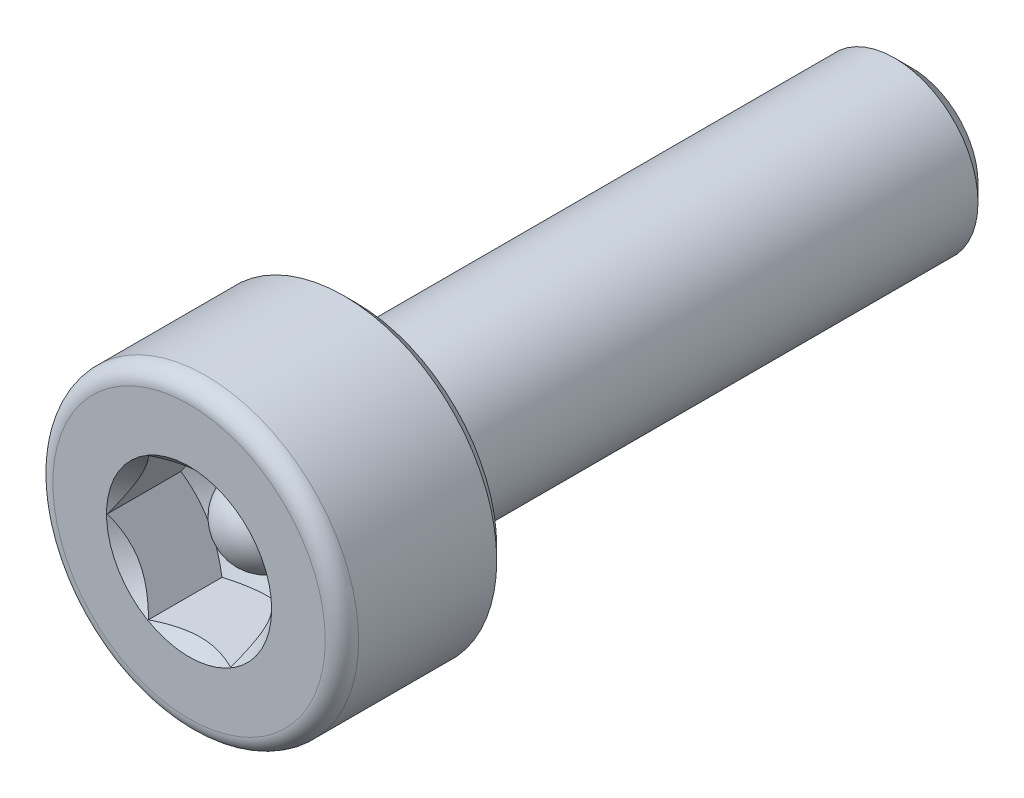
ISO-10303-21;
HEADER;
FILE_DESCRIPTION(('STEP AP214'),'2;1');
FILE_NAME('part.step','',(''),(''),'','','');
FILE_SCHEMA(('AUTOMOTIVE_DESIGN { 1 0 10303 214 1 1 1 1 }'));
ENDSEC;
DATA;
#1=APPLICATION_CONTEXT('core data for automotive mechanical design processes');
#2=APPLICATION_PROTOCOL_DEFINITION('international standard','automotive_design',2000,#1);
#3=PRODUCT_CONTEXT('',#1,'mechanical');
#4=PRODUCT('Part','Part','',(#3));
#5=PRODUCT_RELATED_PRODUCT_CATEGORY('part','',(#4));
#6=PRODUCT_DEFINITION_FORMATION('','',#4);
#7=PRODUCT_DEFINITION_CONTEXT('part definition',#1,'design');
#8=PRODUCT_DEFINITION('design','',#6,#7);
#9=PRODUCT_DEFINITION_SHAPE('','',#8);
#10=(LENGTH_UNIT() NAMED_UNIT(*) SI_UNIT(.MILLI.,.METRE.));
#11=(NAMED_UNIT(*) PLANE_ANGLE_UNIT() SI_UNIT($,.RADIAN.));
#12=(NAMED_UNIT(*) SI_UNIT($,.STERADIAN.) SOLID_ANGLE_UNIT());
#13=UNCERTAINTY_MEASURE_WITH_UNIT(LENGTH_MEASURE(1.E-05),#10,'distance_accuracy_value','');
#14=(GEOMETRIC_REPRESENTATION_CONTEXT(3) GLOBAL_UNCERTAINTY_ASSIGNED_CONTEXT((#13)) GLOBAL_UNIT_ASSIGNED_CONTEXT((#10,
#11,#12)) REPRESENTATION_CONTEXT('',''));
#15=CARTESIAN_POINT('',(0.,0.,0.));
#16=DIRECTION('',(0.,0.,1.));
#17=DIRECTION('',(1.,0.,0.));
#18=AXIS2_PLACEMENT_3D('',#15,#16,#17);
#19=CARTESIAN_POINT('',(0.,0.,1.615850938766));
#20=DIRECTION('',(1.,0.,0.));
#21=DIRECTION('',(0.,-1.,0.));
#22=AXIS2_PLACEMENT_3D('',#19,#20,#21);
#23=SPHERICAL_SURFACE('',#22,0.739008344563);
#24=CARTESIAN_POINT('',(0.739008344562999,0.,1.615850938766));
#25=VERTEX_POINT('',#24);
#26=VERTEX_LOOP('',#25);
#27=FACE_BOUND('',#26,.T.);
#28=CARTESIAN_POINT('',(-0.739008344563001,0.,1.615850938766));
#29=VERTEX_POINT('',#28);
#30=VERTEX_LOOP('',#29);
#31=FACE_BOUND('',#30,.T.);
#32=ADVANCED_FACE('P0_F16',(#27,#31),#23,.T.);
#33=CLOSED_SHELL('',(#32));
#34=MANIFOLD_SOLID_BREP('P0_B1',#33);
#35=CARTESIAN_POINT('',(0.,0.,-0.1));
#36=DIRECTION('',(0.,0.,-1.));
#37=DIRECTION('',(-1.,0.,0.));
#38=AXIS2_PLACEMENT_3D('',#35,#36,#37);
#39=CYLINDRICAL_SURFACE('',#38,1.5);
#40=CARTESIAN_POINT('',(0.,0.,-9.693282669493));
#41=DIRECTION('',(0.,0.,-1.));
#42=DIRECTION('',(-1.,0.,0.));
#43=AXIS2_PLACEMENT_3D('',#40,#41,#42);
#44=CIRCLE('',#43,1.5);
#45=CARTESIAN_POINT('',(-1.5,0.,-9.693282669493));
#46=VERTEX_POINT('',#45);
#47=EDGE_CURVE('P1_E30',#46,#46,#44,.F.);
#48=ORIENTED_EDGE('',*,*,#47,.T.);
#49=EDGE_LOOP('',(#48));
#50=FACE_BOUND('',#49,.T.);
#51=CARTESIAN_POINT('',(0.,0.,-0.1));
#52=DIRECTION('',(0.,0.,-1.));
#53=DIRECTION('',(-1.,0.,0.));
#54=AXIS2_PLACEMENT_3D('',#51,#52,#53);
#55=CIRCLE('',#54,1.5);
#56=CARTESIAN_POINT('',(-1.5,0.,-0.1));
#57=VERTEX_POINT('',#56);
#58=EDGE_CURVE('P1_E11',#57,#57,#55,.T.);
#59=ORIENTED_EDGE('',*,*,#58,.T.);
#60=EDGE_LOOP('',(#59));
#61=FACE_BOUND('',#60,.T.);
#62=ADVANCED_FACE('P1_F17',(#50,#61),#39,.T.);
#63=CARTESIAN_POINT('',(0.,0.,-0.1));
#64=DIRECTION('',(0.,0.,-1.));
#65=DIRECTION('',(1.,0.,0.));
#66=AXIS2_PLACEMENT_3D('',#63,#64,#65);
#67=TOROIDAL_SURFACE('',#66,1.6,0.1);
#68=ORIENTED_EDGE('',*,*,#58,.F.);
#69=EDGE_LOOP('',(#68));
#70=FACE_BOUND('',#69,.T.);
#71=CARTESIAN_POINT('',(0.,0.,0.));
#72=DIRECTION('',(0.,0.,-1.));
#73=DIRECTION('',(1.,0.,0.));
#74=AXIS2_PLACEMENT_3D('',#71,#72,#73);
#75=CIRCLE('',#74,1.6);
#76=CARTESIAN_POINT('',(1.6,0.,0.));
#77=VERTEX_POINT('',#76);
#78=EDGE_CURVE('P1_E123',#77,#77,#75,.F.);
#79=ORIENTED_EDGE('',*,*,#78,.F.);
#80=EDGE_LOOP('',(#79));
#81=FACE_BOUND('',#80,.T.);
#82=ADVANCED_FACE('P1_F295',(#70,#81),#67,.F.);
#83=CARTESIAN_POINT('',(0.,0.,-9.69328266961611));
#84=DIRECTION('',(0.,0.,1.));
#85=DIRECTION('',(1.,0.,0.));
#86=AXIS2_PLACEMENT_3D('',#83,#84,#85);
#87=CONICAL_SURFACE('',#86,1.49999999990769,0.785398163397448);
#88=CARTESIAN_POINT('',(0.,0.,-9.99999999999091));
#89=DIRECTION('',(0.,0.,1.));
#90=DIRECTION('',(1.,0.,0.));
#91=AXIS2_PLACEMENT_3D('',#88,#89,#90);
#92=CIRCLE('',#91,1.19328266953289);
#93=CARTESIAN_POINT('',(1.19328266953289,0.,-9.99999999999091));
#94=VERTEX_POINT('',#93);
#95=EDGE_CURVE('P1_E120',#94,#94,#92,.T.);
#96=ORIENTED_EDGE('',*,*,#95,.T.);
#97=EDGE_LOOP('',(#96));
#98=FACE_BOUND('',#97,.T.);
#99=ORIENTED_EDGE('',*,*,#47,.F.);
#100=EDGE_LOOP('',(#99));
#101=FACE_BOUND('',#100,.T.);
#102=ADVANCED_FACE('P1_F286',(#98,#101),#87,.T.);
#103=CARTESIAN_POINT('',(0.,0.,0.));
#104=DIRECTION('',(0.,0.,1.));
#105=DIRECTION('',(1.,0.,0.));
#106=AXIS2_PLACEMENT_3D('',#103,#104,#105);
#107=PLANE('',#106);
#108=ORIENTED_EDGE('',*,*,#78,.T.);
#109=EDGE_LOOP('',(#108));
#110=FACE_BOUND('',#109,.T.);
#111=CARTESIAN_POINT('',(0.,0.,0.));
#112=DIRECTION('',(0.,0.,1.));
#113=DIRECTION('',(1.,0.,0.));
#114=AXIS2_PLACEMENT_3D('',#111,#112,#113);
#115=CIRCLE('',#114,2.5349999999662);
#116=CARTESIAN_POINT('',(2.5349999999662,0.,0.));
#117=VERTEX_POINT('',#116);
#118=EDGE_CURVE('P1_E124',#117,#117,#115,.T.);
#119=ORIENTED_EDGE('',*,*,#118,.F.);
#120=EDGE_LOOP('',(#119));
#121=FACE_BOUND('',#120,.T.);
#122=ADVANCED_FACE('P1_F277',(#110,#121),#107,.F.);
#123=CARTESIAN_POINT('',(0.,0.,-10.));
#124=DIRECTION('',(0.,0.,1.));
#125=DIRECTION('',(1.,0.,0.));
#126=AXIS2_PLACEMENT_3D('',#123,#124,#125);
#127=PLANE('',#126);
#128=ORIENTED_EDGE('',*,*,#95,.F.);
#129=EDGE_LOOP('',(#128));
#130=FACE_BOUND('',#129,.T.);
#131=ADVANCED_FACE('P1_F268',(#130),#127,.F.);
#132=CARTESIAN_POINT('',(0.,0.,0.215000000025612));
#133=DIRECTION('',(0.,0.,1.));
#134=DIRECTION('',(1.,0.,0.));
#135=AXIS2_PLACEMENT_3D('',#132,#133,#134);
#136=CONICAL_SURFACE('',#135,2.74999999993497,0.785398163265254);
#137=ORIENTED_EDGE('',*,*,#118,.T.);
#138=EDGE_LOOP('',(#137));
#139=FACE_BOUND('',#138,.T.);
#140=CARTESIAN_POINT('',(0.,0.,0.215000000025612));
#141=DIRECTION('',(0.,0.,1.));
#142=DIRECTION('',(1.,0.,0.));
#143=AXIS2_PLACEMENT_3D('',#140,#141,#142);
#144=CIRCLE('',#143,2.74999999993497);
#145=CARTESIAN_POINT('',(2.74999999993497,0.,0.215000000025612));
#146=VERTEX_POINT('',#145);
#147=EDGE_CURVE('P1_E127',#146,#146,#144,.F.);
#148=ORIENTED_EDGE('',*,*,#147,.T.);
#149=EDGE_LOOP('',(#148));
#150=FACE_BOUND('',#149,.T.);
#151=ADVANCED_FACE('P1_F259',(#139,#150),#136,.T.);
#152=CARTESIAN_POINT('',(0.,0.,2.7));
#153=DIRECTION('',(0.,0.,-1.));
#154=DIRECTION('',(-1.,0.,0.));
#155=AXIS2_PLACEMENT_3D('',#152,#153,#154);
#156=CYLINDRICAL_SURFACE('',#155,2.75);
#157=ORIENTED_EDGE('',*,*,#147,.F.);
#158=EDGE_LOOP('',(#157));
#159=FACE_BOUND('',#158,.T.);
#160=CARTESIAN_POINT('',(0.,0.,2.7));
#161=DIRECTION('',(0.,0.,-1.));
#162=DIRECTION('',(-1.,0.,0.));
#163=AXIS2_PLACEMENT_3D('',#160,#161,#162);
#164=CIRCLE('',#163,2.75);
#165=CARTESIAN_POINT('',(-2.75,0.,2.7));
#166=VERTEX_POINT('',#165);
#167=EDGE_CURVE('P1_E434',#166,#166,#164,.T.);
#168=ORIENTED_EDGE('',*,*,#167,.T.);
#169=EDGE_LOOP('',(#168));
#170=FACE_BOUND('',#169,.T.);
#171=ADVANCED_FACE('P1_F251',(#159,#170),#156,.T.);
#172=CARTESIAN_POINT('',(0.,0.,2.7));
#173=DIRECTION('',(0.,0.,-1.));
#174=DIRECTION('',(1.,0.,0.));
#175=AXIS2_PLACEMENT_3D('',#172,#173,#174);
#176=TOROIDAL_SURFACE('',#175,2.45,0.3);
#177=ORIENTED_EDGE('',*,*,#167,.F.);
#178=EDGE_LOOP('',(#177));
#179=FACE_BOUND('',#178,.T.);
#180=CARTESIAN_POINT('',(0.,0.,3.));
#181=DIRECTION('',(0.,0.,-1.));
#182=DIRECTION('',(1.,0.,0.));
#183=AXIS2_PLACEMENT_3D('',#180,#181,#182);
#184=CIRCLE('',#183,2.45);
#185=CARTESIAN_POINT('',(2.45,0.,3.));
#186=VERTEX_POINT('',#185);
#187=EDGE_CURVE('P1_E131',#186,#186,#184,.F.);
#188=ORIENTED_EDGE('',*,*,#187,.F.);
#189=EDGE_LOOP('',(#188));
#190=FACE_BOUND('',#189,.T.);
#191=ADVANCED_FACE('P1_F243',(#179,#190),#176,.T.);
#192=CARTESIAN_POINT('',(0.,0.,3.));
#193=DIRECTION('',(0.,0.,1.));
#194=DIRECTION('',(1.,0.,0.));
#195=AXIS2_PLACEMENT_3D('',#192,#193,#194);
#196=PLANE('',#195);
#197=ORIENTED_EDGE('',*,*,#187,.T.);
#198=EDGE_LOOP('',(#197));
#199=FACE_BOUND('',#198,.T.);
#200=CARTESIAN_POINT('',(0.,0.,2.99999999998591));
#201=DIRECTION('',(0.,0.,1.));
#202=DIRECTION('',(1.,0.,0.));
#203=AXIS2_PLACEMENT_3D('',#200,#201,#202);
#204=CIRCLE('',#203,1.4854439087344);
#205=CARTESIAN_POINT('',(1.4854439087344,0.,2.99999999998591));
#206=VERTEX_POINT('',#205);
#207=EDGE_CURVE('P1_E128',#206,#206,#204,.F.);
#208=ORIENTED_EDGE('',*,*,#207,.T.);
#209=EDGE_LOOP('',(#208));
#210=FACE_BOUND('',#209,.T.);
#211=ADVANCED_FACE('P1_F150',(#199,#210),#196,.T.);
#212=CARTESIAN_POINT('',(0.,0.,2.99999999998591));
#213=DIRECTION('',(0.,0.,1.));
#214=DIRECTION('',(1.,0.,0.));
#215=AXIS2_PLACEMENT_3D('',#212,#213,#214);
#216=CONICAL_SURFACE('',#215,1.4854439087344,0.785398163397448);
#217=ORIENTED_EDGE('',*,*,#207,.F.);
#218=EDGE_LOOP('',(#217));
#219=FACE_BOUND('',#218,.T.);
#220=CARTESIAN_POINT('',(-0.73900833039765,1.28000002453511,2.99257279454244));
#221=CARTESIAN_POINT('',(-0.764408407762743,1.23600580002261,2.96719708967992));
#222=CARTESIAN_POINT('',(-0.790233176713148,1.1912759881068,2.94331199094595));
#223=CARTESIAN_POINT('',(-0.842892530835465,1.10006731127323,2.89957939484165));
#224=CARTESIAN_POINT('',(-0.869732121178957,1.05357977714399,2.87975622232529));
#225=CARTESIAN_POINT('',(-0.923852835173947,0.959839950762813,2.84579898979231));
#226=CARTESIAN_POINT('',(-0.951120183396314,0.912611518254026,2.83157960268337));
#227=CARTESIAN_POINT('',(-1.0062550176399,0.817115184077292,2.80967194523321));
#228=CARTESIAN_POINT('',(-1.03412082054732,0.768850197647961,2.80196732772804));
#229=CARTESIAN_POINT('',(-1.08215006859365,0.68566109978243,2.79501535623299));
#230=CARTESIAN_POINT('',(-1.10225153047865,0.650844346491229,2.79398660559318));
#231=CARTESIAN_POINT('',(-1.14241907185677,0.581272124009232,2.795722599224));
#232=CARTESIAN_POINT('',(-1.16248514255375,0.546516670053808,2.79848818146684));
#233=CARTESIAN_POINT('',(-1.20242355510745,0.477341310337187,2.80765297004438));
#234=CARTESIAN_POINT('',(-1.22229569931528,0.442921746913914,2.814055555235));
#235=CARTESIAN_POINT('',(-1.26170819927281,0.374657294534199,2.83014952360517));
#236=CARTESIAN_POINT('',(-1.28124840886902,0.340812658723032,2.83984231799677));
#237=CARTESIAN_POINT('',(-1.3312711614295,0.254170709753885,2.86859538704998));
#238=CARTESIAN_POINT('',(-1.3614389218517,0.201918615952089,2.88981369969133));
#239=CARTESIAN_POINT('',(-1.42059417461341,0.0994587126342793,2.93760802816772));
#240=CARTESIAN_POINT('',(-1.44958514902605,0.0492448719906819,2.9641666033907));
#241=CARTESIAN_POINT('',(-1.47801665262797,6.32166031965428E-08,2.99257274387948));
#242=B_SPLINE_CURVE_WITH_KNOTS('',3,(#220,#221,#222,#223,#224,#225,#226,#227,#228,#229,#230,
#231,#232,#233,#234,#235,#236,#237,#238,#239,#240,#241),.UNSPECIFIED.,.F.,.F.,(4,2,2,2,2,2,2,2,
2,2,4),(0.,0.170474178045342,0.341941186072123,0.510685878115575,0.679005880861946,
0.799483496257405,0.919987723220982,1.04060408478871,1.16127224573515,1.35282268707442,
1.54375742347497),.UNSPECIFIED.);
#243=CARTESIAN_POINT('',(-0.739008307823175,1.28,2.99257276200718));
#244=VERTEX_POINT('',#243);
#245=CARTESIAN_POINT('',(-1.47801667075188,3.18241214037053E-08,2.99257276200339));
#246=VERTEX_POINT('',#245);
#247=EDGE_CURVE('P1_E39',#244,#246,#242,.T.);
#248=ORIENTED_EDGE('',*,*,#247,.F.);
#249=CARTESIAN_POINT('',(0.739008272408615,1.28000000611594,2.99257274094721));
#250=CARTESIAN_POINT('',(0.688208122719239,1.28000000220067,2.96719704334762));
#251=CARTESIAN_POINT('',(0.636558590484335,1.28000000059091,2.94331195077126));
#252=CARTESIAN_POINT('',(0.531239894532555,1.27999999940565,2.89957936559876));
#253=CARTESIAN_POINT('',(0.477560720480201,1.27999999984207,2.87975619784138));
#254=CARTESIAN_POINT('',(0.369319305960669,1.28000000015542,2.8457989740032));
#255=CARTESIAN_POINT('',(0.314784616340693,1.28000000004114,2.83157959085406));
#256=CARTESIAN_POINT('',(0.20451496200542,1.27999999995897,2.80967193977415));
#257=CARTESIAN_POINT('',(0.148783363515357,1.27999999999072,2.80196732468796));
#258=CARTESIAN_POINT('',(0.0527248750781001,1.28000000000665,2.7950153553539));
#259=CARTESIAN_POINT('',(0.0125219515476335,1.28000000000178,2.79398660539415));
#260=CARTESIAN_POINT('',(-0.0678131306698069,1.27999999999822,2.79572260032543));
#261=CARTESIAN_POINT('',(-0.107945271764465,1.27999999999952,2.79848818318913));
#262=CARTESIAN_POINT('',(-0.187822096259195,1.28000000000048,2.80765297292113));
#263=CARTESIAN_POINT('',(-0.22756638436111,1.28000000000013,2.8140555586481));
#264=CARTESIAN_POINT('',(-0.306391383623088,1.27999999999987,2.83014952798809));
#265=CARTESIAN_POINT('',(-0.34547180247616,1.27999999999996,2.83984232281309));
#266=CARTESIAN_POINT('',(-0.445517304080995,1.28000000000007,2.86859539209756));
#267=CARTESIAN_POINT('',(-0.505852821834524,1.28000000000004,2.88981370415139));
#268=CARTESIAN_POINT('',(-0.62416332131743,1.27999999999997,2.93760803081389));
#269=CARTESIAN_POINT('',(-0.682145267195324,1.27999999999993,2.96416660480513));
#270=CARTESIAN_POINT('',(-0.739008271582371,1.28,2.99257274388677));
#271=B_SPLINE_CURVE_WITH_KNOTS('',3,(#249,#250,#251,#252,#253,#254,#255,#256,#257,#258,#259,
#260,#261,#262,#263,#264,#265,#266,#267,#268,#269,#270),.UNSPECIFIED.,.F.,.F.,(4,2,2,2,2,2,2,2,
2,2,4),(0.,0.17047415492173,0.341941139416434,0.510685808711829,0.679005788888608,
0.799483403509875,0.919987629713267,1.04060399061424,1.16127215089304,1.35282258295895,
1.54375730985654),.UNSPECIFIED.);
#272=CARTESIAN_POINT('',(0.739008337482733,1.28000001226243,2.99257278745654));
#273=VERTEX_POINT('',#272);
#274=EDGE_CURVE('P1_E165',#273,#244,#271,.T.);
#275=ORIENTED_EDGE('',*,*,#274,.F.);
#276=CARTESIAN_POINT('',(1.47801667853174,1.8348056452837E-08,2.99257276978325));
#277=CARTESIAN_POINT('',(1.45261660259499,0.0439942403865975,2.96719706761263));
#278=CARTESIAN_POINT('',(1.42679183511048,0.08872404976341,2.94331197153223));
#279=CARTESIAN_POINT('',(1.37413248406308,0.179932721271057,2.89957938050909));
#280=CARTESIAN_POINT('',(1.34729289533023,0.226420252610582,2.87975621041389));
#281=CARTESIAN_POINT('',(1.29317218473374,0.320160073105397,2.84579898225534));
#282=CARTESIAN_POINT('',(1.26590483829921,0.367388502517554,2.83157959709393));
#283=CARTESIAN_POINT('',(1.21077000774575,0.462884830302806,2.80967194275167));
#284=CARTESIAN_POINT('',(1.18290420673992,0.511149813438469,2.80196732641221));
#285=CARTESIAN_POINT('',(1.13487496071501,0.594338907802802,2.7950153558772));
#286=CARTESIAN_POINT('',(1.11477349892741,0.629155660925311,2.79398660551534));
#287=CARTESIAN_POINT('',(1.07460595775605,0.698727883049189,2.79572259966083));
#288=CARTESIAN_POINT('',(1.05453988716844,0.733483336815178,2.79848818214051));
#289=CARTESIAN_POINT('',(1.01460147479739,0.802658696215434,2.80765297114743));
#290=CARTESIAN_POINT('',(0.994729330663319,0.83707825951096,2.81405555653851));
#291=CARTESIAN_POINT('',(0.95531683085651,0.905342711629617,2.83014952526765));
#292=CARTESIAN_POINT('',(0.935776621337286,0.939187347307438,2.83984231981792));
#293=CARTESIAN_POINT('',(0.885753860349397,1.02582931087329,2.86859539417932));
#294=CARTESIAN_POINT('',(0.855586091716678,1.07808141889612,2.88981371394575));
#295=CARTESIAN_POINT('',(0.79643082320749,1.18054134948936,2.93760805912835));
#296=CARTESIAN_POINT('',(0.767439841253866,1.23075520319432,2.9641666439137));
#297=CARTESIAN_POINT('',(0.739008330402467,1.28000002452487,2.99257279453598));
#298=B_SPLINE_CURVE_WITH_KNOTS('',3,(#276,#277,#278,#279,#280,#281,#282,#283,#284,#285,#286,
#287,#288,#289,#290,#291,#292,#293,#294,#295,#296,#297),.UNSPECIFIED.,.F.,.F.,(4,2,2,2,2,2,2,2,
2,2,4),(0.,0.170474166745542,0.341941163208504,0.510685843446508,0.679005834505185,
0.799483449295664,0.91998767565746,1.040604036887,1.16127219750169,1.35282269216248,
1.54375748133644),.UNSPECIFIED.);
#299=CARTESIAN_POINT('',(1.47801667853205,-4.26931163012624E-13,2.99257276978356));
#300=VERTEX_POINT('',#299);
#301=EDGE_CURVE('P1_E171',#300,#273,#298,.T.);
#302=ORIENTED_EDGE('',*,*,#301,.F.);
#303=CARTESIAN_POINT('',(0.739008330397649,-1.28000002453511,2.99257279454244));
#304=CARTESIAN_POINT('',(0.764408407784721,-1.23600579998454,2.96719708965798));
#305=CARTESIAN_POINT('',(0.790233176757962,-1.19127598802918,2.94331199090453));
#306=CARTESIAN_POINT('',(0.842892530927419,-1.10006731111396,2.89957939476955));
#307=CARTESIAN_POINT('',(0.869732121295217,-1.05357977694262,2.87975622224202));
#308=CARTESIAN_POINT('',(0.923852835292992,-0.959839950556622,2.84579898972774));
#309=CARTESIAN_POINT('',(0.951120183492341,-0.912611518087701,2.83157960263935));
#310=CARTESIAN_POINT('',(1.00625501768864,-0.817115183992871,2.80967194521967));
#311=CARTESIAN_POINT('',(1.0341208205718,-0.768850197605565,2.80196732772449));
#312=CARTESIAN_POINT('',(1.08215006858505,-0.685661099797333,2.79501535623424));
#313=CARTESIAN_POINT('',(1.10225153046139,-0.650844346521124,2.79398660559405));
#314=CARTESIAN_POINT('',(1.14241907182218,-0.581272124069146,2.79572259922089));
#315=CARTESIAN_POINT('',(1.16248514251048,-0.546516670128749,2.79848818146012));
#316=CARTESIAN_POINT('',(1.20242355506417,-0.477341310412151,2.80765297003124));
#317=CARTESIAN_POINT('',(1.22229569928048,-0.442921746974186,2.81405555522214));
#318=CARTESIAN_POINT('',(1.26170819925536,-0.374657294564425,2.8301495235967));
#319=CARTESIAN_POINT('',(1.28124840886042,-0.340812658737923,2.83984231799251));
#320=CARTESIAN_POINT('',(1.33127116608195,-0.254170701695607,2.86859538972314));
#321=CARTESIAN_POINT('',(1.36143893099818,-0.201918600109919,2.8898137061194));
#322=CARTESIAN_POINT('',(1.42059419239467,-0.0994586818362385,2.9376080434876));
#323=CARTESIAN_POINT('',(1.44958517094973,-0.0492448340177656,2.96416662383977));
#324=CARTESIAN_POINT('',(1.47801667853235,-1.83489103127095E-08,2.99257276978386));
#325=B_SPLINE_CURVE_WITH_KNOTS('',3,(#303,#304,#305,#306,#307,#308,#309,#310,#311,#312,#313,
#314,#315,#316,#317,#318,#319,#320,#321,#322,#323,#324),.UNSPECIFIED.,.F.,.F.,(4,2,2,2,2,2,2,2,
2,2,4),(0.,0.170474178193379,0.341941186367865,0.510685878262844,0.679005880862118,
0.7994834962059,0.919987723117027,1.04060408473501,1.16127224573534,1.35282271611338,
1.54375748134627),.UNSPECIFIED.);
#326=CARTESIAN_POINT('',(0.739008307823175,-1.28,2.99257276200718));
#327=VERTEX_POINT('',#326);
#328=EDGE_CURVE('P1_E95',#327,#300,#325,.T.);
#329=ORIENTED_EDGE('',*,*,#328,.F.);
#330=CARTESIAN_POINT('',(-0.739008372896817,-1.28,2.992572794544));
#331=CARTESIAN_POINT('',(-0.688208218166412,-1.28,2.96719708968126));
#332=CARTESIAN_POINT('',(-0.636558680265378,-1.28,2.94331199094707));
#333=CARTESIAN_POINT('',(-0.53123997202027,-1.28,2.89957939484236));
#334=CARTESIAN_POINT('',(-0.477560791333037,-1.28,2.87975622232579));
#335=CARTESIAN_POINT('',(-0.369319363342573,-1.28,2.84579898979248));
#336=CARTESIAN_POINT('',(-0.314784666897608,-1.28,2.83157960268339));
#337=CARTESIAN_POINT('',(-0.204514998409948,-1.28,2.809671945233));
#338=CARTESIAN_POINT('',(-0.148783392594856,-1.28,2.80196732772774));
#339=CARTESIAN_POINT('',(-0.0527248965019614,-1.28,2.79501535623261));
#340=CARTESIAN_POINT('',(-0.0125219727319932,-1.28,2.79398660559279));
#341=CARTESIAN_POINT('',(0.0678131100242127,-1.28,2.79572259922356));
#342=CARTESIAN_POINT('',(0.107945251418159,-1.28,2.79848818146638));
#343=CARTESIAN_POINT('',(0.187822076525533,-1.28,2.80765297004388));
#344=CARTESIAN_POINT('',(0.227566364941178,-1.28,2.81405555523448));
#345=CARTESIAN_POINT('',(0.306391364856226,-1.28,2.83014952360461));
#346=CARTESIAN_POINT('',(0.345471784048643,-1.28,2.8398423179962));
#347=CARTESIAN_POINT('',(0.445517289172432,-1.28,2.8685953870502));
#348=CARTESIAN_POINT('',(0.505852810019584,-1.28,2.88981369969269));
#349=CARTESIAN_POINT('',(0.624163315548282,-1.28,2.93760802817178));
#350=CARTESIAN_POINT('',(0.682145264376096,-1.28,2.96416660339633));
#351=CARTESIAN_POINT('',(0.739008271582371,-1.28,2.99257274388677));
#352=B_SPLINE_CURVE_WITH_KNOTS('',3,(#330,#331,#332,#333,#334,#335,#336,#337,#338,#339,#340,
#341,#342,#343,#344,#345,#346,#347,#348,#349,#350,#351),.UNSPECIFIED.,.F.,.F.,(4,2,2,2,2,2,2,2,
2,2,4),(0.,0.170474178046279,0.34194118607402,0.510685878118316,0.679005880865522,
0.799483496260969,0.919987723224533,1.04060408479228,1.16127224573873,1.35282268708692,
1.54375742349635),.UNSPECIFIED.);
#353=CARTESIAN_POINT('',(-0.739008362932853,-1.27999996818058,2.99257276200559));
#354=VERTEX_POINT('',#353);
#355=EDGE_CURVE('P1_E93',#354,#327,#352,.T.);
#356=ORIENTED_EDGE('',*,*,#355,.F.);
#357=CARTESIAN_POINT('',(-1.47801670328417,2.45243962858424E-08,2.99257279453568));
#358=CARTESIAN_POINT('',(-1.45261662591942,-0.0439941999874959,2.9671970896738));
#359=CARTESIAN_POINT('',(-1.42679185696938,-0.088724011902678,2.94331199094046));
#360=CARTESIAN_POINT('',(-1.37413250284782,-0.179932688734942,2.89957939483736));
#361=CARTESIAN_POINT('',(-1.34729291250472,-0.2264202228635,2.87975622232157));
#362=CARTESIAN_POINT('',(-1.29317219851055,-0.320160049243261,2.84579898978961));
#363=CARTESIAN_POINT('',(-1.2659048502886,-0.367388481751313,2.83157960268112));
#364=CARTESIAN_POINT('',(-1.21077001604589,-0.462884815926531,2.80967194523168));
#365=CARTESIAN_POINT('',(-1.18290421313892,-0.51114980235508,2.80196732772679));
#366=CARTESIAN_POINT('',(-1.13487496509308,-0.594338900219759,2.79501535623196));
#367=CARTESIAN_POINT('',(-1.11477350320812,-0.6291556535109,2.79398660559222));
#368=CARTESIAN_POINT('',(-1.07460596183007,-0.69872787599277,2.79572259922315));
#369=CARTESIAN_POINT('',(-1.05453989113313,-0.733483329948128,2.79848818146604));
#370=CARTESIAN_POINT('',(-1.0146014785795,-0.802658689664624,2.80765297004368));
#371=CARTESIAN_POINT('',(-0.994729334371709,-0.83707825308784,2.81405555523434));
#372=CARTESIAN_POINT('',(-0.955316834414246,-0.905342705467438,2.83014952360458));
#373=CARTESIAN_POINT('',(-0.935776624818068,-0.939187341278546,2.83984231799621));
#374=CARTESIAN_POINT('',(-0.885753872256689,-1.02582929024926,2.86859538705004));
#375=CARTESIAN_POINT('',(-0.855586111833582,-1.07808138405262,2.88981369969221));
#376=CARTESIAN_POINT('',(-0.796430859070142,-1.18054128737342,2.9376080281705));
#377=CARTESIAN_POINT('',(-0.767439884656676,-1.23075512801845,2.96416660339457));
#378=CARTESIAN_POINT('',(-0.739008381053962,-1.2799999367939,2.99257274388449));
#379=B_SPLINE_CURVE_WITH_KNOTS('',3,(#357,#358,#359,#360,#361,#362,#363,#364,#365,#366,#367,
#368,#369,#370,#371,#372,#373,#374,#375,#376,#377,#378),.UNSPECIFIED.,.F.,.F.,(4,2,2,2,2,2,2,2,
2,2,4),(0.,0.170474178042595,0.34194118606657,0.510685878107226,0.679005880850828,
0.79948349624607,0.919987723209431,1.04060408477699,1.16127224572325,1.35282268706841,
1.54375742347479),.UNSPECIFIED.);
#380=EDGE_CURVE('P1_E91',#246,#354,#379,.T.);
#381=ORIENTED_EDGE('',*,*,#380,.F.);
#382=EDGE_LOOP('',(#248,#275,#302,#329,#356,#381));
#383=FACE_BOUND('',#382,.T.);
#384=ADVANCED_FACE('P1_F146',(#219,#383),#216,.F.);
#385=CARTESIAN_POINT('',(-1.478016689125,0.,4.));
#386=DIRECTION('',(-0.866025403784329,-0.50000000000019,0.));
#387=DIRECTION('',(0.50000000000019,-0.866025403784329,0.));
#388=AXIS2_PLACEMENT_3D('',#385,#386,#387);
#389=PLANE('',#388);
#390=CARTESIAN_POINT('',(-1.47801668912927,7.40140874405819E-12,1.66821187995555));
#391=CARTESIAN_POINT('',(-1.44543422538176,-0.0564344826390374,1.64869441099508));
#392=CARTESIAN_POINT('',(-1.41254915183333,-0.113393100835532,1.63093697134104));
#393=CARTESIAN_POINT('',(-1.3461645207857,-0.22837465465167,1.59995007271958));
#394=CARTESIAN_POINT('',(-1.31266357555924,-0.286399993885459,1.58673263572));
#395=CARTESIAN_POINT('',(-1.24610867453935,-0.401676463944573,1.56622424110573));
#396=CARTESIAN_POINT('',(-1.2130665937308,-0.458907026692746,1.55878475304556));
#397=CARTESIAN_POINT('',(-1.14681860473037,-0.573651909540697,1.5499903879319));
#398=CARTESIAN_POINT('',(-1.1136129775487,-0.631165742916505,1.54862731922389));
#399=CARTESIAN_POINT('',(-1.05184366410041,-0.738153332157539,1.5518632069523));
#400=CARTESIAN_POINT('',(-1.02326863836162,-0.787646728564677,1.55566923535867));
#401=CARTESIAN_POINT('',(-0.966319631082127,-0.886285302613328,1.56759997183644));
#402=CARTESIAN_POINT('',(-0.937945879656263,-0.935430081684229,1.57572900305517));
#403=CARTESIAN_POINT('',(-0.88087388118021,-1.0342816827342,1.59600087659475));
#404=CARTESIAN_POINT('',(-0.852183896751241,-1.08397419343351,1.60823433680883));
#405=CARTESIAN_POINT('',(-0.795260914250543,-1.18256769124302,1.6359541883402));
#406=CARTESIAN_POINT('',(-0.767027075163526,-1.23147013503443,1.6514336171397));
#407=CARTESIAN_POINT('',(-0.739008344558036,-1.2800000000067,1.66821187995533));
#408=B_SPLINE_CURVE_WITH_KNOTS('',3,(#390,#391,#392,#393,#394,#395,#396,#397,#398,#399,#400,
#401,#402,#403,#404,#405,#406,#407),.UNSPECIFIED.,.F.,.F.,(4,2,2,2,2,2,2,2,4),(0.,
0.204164271419992,0.408865077483371,0.608111505081253,0.807089246080721,0.978746004979672,
1.15057475007757,1.32647851521597,1.5020087617587),.UNSPECIFIED.);
#409=CARTESIAN_POINT('',(-1.47801668912744,-3.27435413642058E-12,1.66821187995445));
#410=VERTEX_POINT('',#409);
#411=CARTESIAN_POINT('',(-0.739008344564367,-1.28000000000335,1.66821187995549));
#412=VERTEX_POINT('',#411);
#413=EDGE_CURVE('P1_E72',#410,#412,#408,.T.);
#414=ORIENTED_EDGE('',*,*,#413,.F.);
#415=DIRECTION('',(0.,0.,1.));
#416=VECTOR('',#415,1.);
#417=CARTESIAN_POINT('',(-1.478016689125,0.,4.));
#418=LINE('',#417,#416);
#419=EDGE_CURVE('P1_E80',#246,#410,#418,.F.);
#420=ORIENTED_EDGE('',*,*,#419,.F.);
#421=ORIENTED_EDGE('',*,*,#380,.T.);
#422=DIRECTION('',(0.,0.,1.));
#423=VECTOR('',#422,1.);
#424=CARTESIAN_POINT('',(-0.739008344562178,-1.27999999999953,4.));
#425=LINE('',#424,#423);
#426=EDGE_CURVE('P1_E79',#412,#354,#425,.T.);
#427=ORIENTED_EDGE('',*,*,#426,.F.);
#428=EDGE_LOOP('',(#414,#420,#421,#427));
#429=FACE_BOUND('',#428,.T.);
#430=ADVANCED_FACE('P1_F89',(#429),#389,.F.);
#431=CARTESIAN_POINT('',(-0.739008344563,1.28,4.));
#432=DIRECTION('',(-0.866025403784329,0.50000000000019,0.));
#433=DIRECTION('',(-0.50000000000019,-0.866025403784329,0.));
#434=AXIS2_PLACEMENT_3D('',#431,#432,#433);
#435=PLANE('',#434);
#436=CARTESIAN_POINT('',(-0.739008344558926,1.28000000000706,1.66821187995578));
#437=CARTESIAN_POINT('',(-0.771590808306453,1.2235655173606,1.64869441099533));
#438=CARTESIAN_POINT('',(-0.804475881854898,1.16660689916408,1.63093697134131));
#439=CARTESIAN_POINT('',(-0.870860512902544,1.0516253453479,1.59995007271991));
#440=CARTESIAN_POINT('',(-0.904361458129021,0.99360000611409,1.58673263572036));
#441=CARTESIAN_POINT('',(-0.970916359148938,0.878323536054935,1.56622424110616));
#442=CARTESIAN_POINT('',(-1.0039584399575,0.821092973306742,1.55878475304601));
#443=CARTESIAN_POINT('',(-1.07020642895795,0.706348090458752,1.54999038793243));
#444=CARTESIAN_POINT('',(-1.10341205613963,0.648834257082926,1.54862731922445));
#445=CARTESIAN_POINT('',(-1.16518136958789,0.541846667841935,1.55186320695292));
#446=CARTESIAN_POINT('',(-1.19375639532664,0.492353271434859,1.55566923535931));
#447=CARTESIAN_POINT('',(-1.25070540260607,0.39371469738633,1.56759997183711));
#448=CARTESIAN_POINT('',(-1.2790791540319,0.344569918315489,1.57572900305584));
#449=CARTESIAN_POINT('',(-1.33615115250788,0.245718317265647,1.59600087659542));
#450=CARTESIAN_POINT('',(-1.36484113693681,0.1960258065664,1.60823433680949));
#451=CARTESIAN_POINT('',(-1.42176411943744,0.0974323087570131,1.63595418834082));
#452=CARTESIAN_POINT('',(-1.44999795852442,0.0485298649656601,1.65143361714031));
#453=CARTESIAN_POINT('',(-1.47801668912988,-6.54871701998737E-12,1.66821187995591));
#454=B_SPLINE_CURVE_WITH_KNOTS('',3,(#436,#437,#438,#439,#440,#441,#442,#443,#444,#445,#446,
#447,#448,#449,#450,#451,#452,#453),.UNSPECIFIED.,.F.,.F.,(4,2,2,2,2,2,2,2,4),(0.,
0.204164271420047,0.408865077483478,0.608111505081418,0.807089246080946,0.978746004979692,
1.15057475007739,1.32647851521556,1.50200876175807),.UNSPECIFIED.);
#455=CARTESIAN_POINT('',(-0.739008344567075,1.28,1.66821187995456));
#456=VERTEX_POINT('',#455);
#457=EDGE_CURVE('P1_E76',#456,#410,#454,.T.);
#458=ORIENTED_EDGE('',*,*,#457,.F.);
#459=DIRECTION('',(0.,0.,1.));
#460=VECTOR('',#459,1.);
#461=CARTESIAN_POINT('',(-0.739008344563,1.28,4.));
#462=LINE('',#461,#460);
#463=EDGE_CURVE('P1_E104',#244,#456,#462,.F.);
#464=ORIENTED_EDGE('',*,*,#463,.F.);
#465=ORIENTED_EDGE('',*,*,#247,.T.);
#466=ORIENTED_EDGE('',*,*,#419,.T.);
#467=EDGE_LOOP('',(#458,#464,#465,#466));
#468=FACE_BOUND('',#467,.T.);
#469=ADVANCED_FACE('P1_F210',(#468),#435,.F.);
#470=CARTESIAN_POINT('',(0.739008344563,1.28,4.));
#471=DIRECTION('',(0.,1.,0.));
#472=DIRECTION('',(-1.,0.,0.));
#473=AXIS2_PLACEMENT_3D('',#470,#471,#472);
#474=PLANE('',#473);
#475=CARTESIAN_POINT('',(0.739008344570848,1.28,1.66821187995569));
#476=CARTESIAN_POINT('',(0.673843417075828,1.28,1.64869441099523));
#477=CARTESIAN_POINT('',(0.608073269978974,1.28,1.6309369713412));
#478=CARTESIAN_POINT('',(0.47530400788375,1.28,1.59995007271978));
#479=CARTESIAN_POINT('',(0.408302117430832,1.28,1.58673263572021));
#480=CARTESIAN_POINT('',(0.275192315391068,1.28,1.56622424110598));
#481=CARTESIAN_POINT('',(0.209108153773983,1.28,1.55878475304582));
#482=CARTESIAN_POINT('',(0.0766121757731466,1.28,1.5499903879322));
#483=CARTESIAN_POINT('',(0.0102009214098261,1.28,1.54862731922421));
#484=CARTESIAN_POINT('',(-0.113337705486716,1.28,1.55186320695265));
#485=CARTESIAN_POINT('',(-0.170487756964257,1.28,1.55566923535904));
#486=CARTESIAN_POINT('',(-0.284385771523198,1.28,1.56759997183684));
#487=CARTESIAN_POINT('',(-0.341133274374897,1.28,1.57572900305558));
#488=CARTESIAN_POINT('',(-0.455277271326945,1.28,1.59600087659518));
#489=CARTESIAN_POINT('',(-0.512657240184855,1.28,1.60823433680927));
#490=CARTESIAN_POINT('',(-0.626503205186191,1.28,1.63595418834064));
#491=CARTESIAN_POINT('',(-0.682970883360198,1.28,1.65143361714015));
#492=CARTESIAN_POINT('',(-0.739008344571149,1.28,1.66821187995578));
#493=B_SPLINE_CURVE_WITH_KNOTS('',3,(#475,#476,#477,#478,#479,#480,#481,#482,#483,#484,#485,
#486,#487,#488,#489,#490,#491,#492),.UNSPECIFIED.,.F.,.F.,(4,2,2,2,2,2,2,2,4),(0.,
0.204164271420026,0.408865077483438,0.608111505081354,0.807089246080858,0.978746004979794,
1.15057475007768,1.32647851521606,1.50200876175877),.UNSPECIFIED.);
#494=CARTESIAN_POINT('',(0.739008344560518,1.28000000000335,1.66821187995434));
#495=VERTEX_POINT('',#494);
#496=EDGE_CURVE('P1_E107',#495,#456,#493,.T.);
#497=ORIENTED_EDGE('',*,*,#496,.F.);
#498=DIRECTION('',(0.,0.,1.));
#499=VECTOR('',#498,1.);
#500=CARTESIAN_POINT('',(0.739008344563,1.28,4.));
#501=LINE('',#500,#499);
#502=EDGE_CURVE('P1_E108',#273,#495,#501,.F.);
#503=ORIENTED_EDGE('',*,*,#502,.F.);
#504=ORIENTED_EDGE('',*,*,#274,.T.);
#505=ORIENTED_EDGE('',*,*,#463,.T.);
#506=EDGE_LOOP('',(#497,#503,#504,#505));
#507=FACE_BOUND('',#506,.T.);
#508=ADVANCED_FACE('P1_F181',(#507),#474,.F.);
#509=CARTESIAN_POINT('',(1.478016689125,0.,4.));
#510=DIRECTION('',(0.866025403784329,0.50000000000019,0.));
#511=DIRECTION('',(-0.50000000000019,0.866025403784329,0.));
#512=AXIS2_PLACEMENT_3D('',#509,#510,#511);
#513=PLANE('',#512);
#514=CARTESIAN_POINT('',(1.47801668354993,9.65630103245288E-09,1.66821187661433));
#515=CARTESIAN_POINT('',(1.44543421989276,0.0564344921462542,1.64869440792664));
#516=CARTESIAN_POINT('',(1.4125491464352,0.113393110185369,1.63093696856329));
#517=CARTESIAN_POINT('',(1.34616451557906,0.228374663669848,1.59995007054716));
#518=CARTESIAN_POINT('',(1.31266357045328,0.286400002729242,1.58673263386182));
#519=CARTESIAN_POINT('',(1.2461086696346,0.401676472439842,1.56622423987106));
#520=CARTESIAN_POINT('',(1.21306658892615,0.458907035014634,1.55878475212147));
#521=CARTESIAN_POINT('',(1.14681860013883,0.573651917493482,1.54999038760769));
#522=CARTESIAN_POINT('',(1.11361297307013,0.631165750673613,1.54862731918921));
#523=CARTESIAN_POINT('',(1.05184366009665,0.738153339092247,1.55186320739498));
#524=CARTESIAN_POINT('',(1.02326863471753,0.78764673487643,1.55566923595509));
#525=CARTESIAN_POINT('',(0.966319628158503,0.886285307677193,1.56759997261617));
#526=CARTESIAN_POINT('',(0.937945877093436,0.935430086123176,1.57572900386416));
#527=CARTESIAN_POINT('',(0.880873879352612,1.03428168589969,1.59600087734782));
#528=CARTESIAN_POINT('',(0.852183895297763,1.083974195951,1.60823433747246));
#529=CARTESIAN_POINT('',(0.79526091353296,1.18256769248591,1.63595418873373));
#530=CARTESIAN_POINT('',(0.767027074807761,1.23147013565064,1.65143361735298));
#531=CARTESIAN_POINT('',(0.739008344558036,1.2800000000067,1.66821187995533));
#532=B_SPLINE_CURVE_WITH_KNOTS('',3,(#514,#515,#516,#517,#518,#519,#520,#521,#522,#523,#524,
#525,#526,#527,#528,#529,#530,#531),.UNSPECIFIED.,.F.,.F.,(4,2,2,2,2,2,2,2,4),(0.,
0.204164270664747,0.40886507595116,0.608111502847714,0.807089243153975,0.978745999938188,
1.15057474291246,1.32647850580417,1.50200875011583),.UNSPECIFIED.);
#533=CARTESIAN_POINT('',(1.47801668633781,-4.82850064795515E-09,1.66821187828386));
#534=VERTEX_POINT('',#533);
#535=EDGE_CURVE('P1_E111',#534,#495,#532,.T.);
#536=ORIENTED_EDGE('',*,*,#535,.F.);
#537=DIRECTION('',(0.,0.,1.));
#538=VECTOR('',#537,1.);
#539=CARTESIAN_POINT('',(1.478016689125,0.,4.));
#540=LINE('',#539,#538);
#541=EDGE_CURVE('P1_E112',#300,#534,#540,.F.);
#542=ORIENTED_EDGE('',*,*,#541,.F.);
#543=ORIENTED_EDGE('',*,*,#301,.T.);
#544=ORIENTED_EDGE('',*,*,#502,.T.);
#545=EDGE_LOOP('',(#536,#542,#543,#544));
#546=FACE_BOUND('',#545,.T.);
#547=ADVANCED_FACE('P1_F177',(#546),#513,.F.);
#548=CARTESIAN_POINT('',(0.739008344563,-1.28,4.));
#549=DIRECTION('',(0.866025403784329,-0.50000000000019,0.));
#550=DIRECTION('',(0.50000000000019,0.866025403784329,0.));
#551=AXIS2_PLACEMENT_3D('',#548,#549,#550);
#552=PLANE('',#551);
#553=CARTESIAN_POINT('',(0.739008344558925,-1.28000000000706,1.66821187995578));
#554=CARTESIAN_POINT('',(0.771590808304517,-1.22356551736395,1.64869441099648));
#555=CARTESIAN_POINT('',(0.804475881850999,-1.16660689917083,1.63093697134341));
#556=CARTESIAN_POINT('',(0.870860512894405,-1.051625345362,1.59995007272343));
#557=CARTESIAN_POINT('',(0.904361458118599,-0.993600006132142,1.58673263572431));
#558=CARTESIAN_POINT('',(0.97091635913816,-0.878323536073603,1.56622424110876));
#559=CARTESIAN_POINT('',(1.0039584399487,-0.821092973321974,1.55878475304754));
#560=CARTESIAN_POINT('',(1.07020642895349,-0.706348090466472,1.54999038793266));
#561=CARTESIAN_POINT('',(1.10341205613752,-0.648834257086567,1.5486273192245));
#562=CARTESIAN_POINT('',(1.1651813691162,-0.541846668658933,1.55186320692807));
#563=CARTESIAN_POINT('',(1.19375639438416,-0.492353273067288,1.55566923523334));
#564=CARTESIAN_POINT('',(1.25070540073041,-0.393714700635074,1.56759997137258));
#565=CARTESIAN_POINT('',(1.27907915169387,-0.34456992236508,1.57572900235355));
#566=CARTESIAN_POINT('',(1.33615114923363,-0.245718322936808,1.59600087530095));
#567=CARTESIAN_POINT('',(1.36484113318925,-0.196025813057378,1.60823433515609));
#568=CARTESIAN_POINT('',(1.42176411476156,-0.0974323168558695,1.63595418589259));
#569=CARTESIAN_POINT('',(1.44999795339348,-0.0485298738527021,1.65143361425668));
#570=CARTESIAN_POINT('',(1.47801668355062,-9.65700133099165E-09,1.66821187661474));
#571=B_SPLINE_CURVE_WITH_KNOTS('',3,(#553,#554,#555,#556,#557,#558,#559,#560,#561,#562,#563,
#564,#565,#566,#567,#568,#569,#570),.UNSPECIFIED.,.F.,.F.,(4,2,2,2,2,2,2,2,4),(0.,
0.204164271407956,0.408865077457716,0.608111505067952,0.80708924608094,0.978746002150112,
1.15057474440697,1.32647850654676,1.50200875011541),.UNSPECIFIED.);
#572=CARTESIAN_POINT('',(0.739008344567075,-1.28,1.66821187995456));
#573=VERTEX_POINT('',#572);
#574=EDGE_CURVE('P1_E115',#573,#534,#571,.T.);
#575=ORIENTED_EDGE('',*,*,#574,.F.);
#576=DIRECTION('',(0.,0.,1.));
#577=VECTOR('',#576,1.);
#578=CARTESIAN_POINT('',(0.739008344563,-1.28,4.));
#579=LINE('',#578,#577);
#580=EDGE_CURVE('P1_E86',#327,#573,#579,.F.);
#581=ORIENTED_EDGE('',*,*,#580,.F.);
#582=ORIENTED_EDGE('',*,*,#328,.T.);
#583=ORIENTED_EDGE('',*,*,#541,.T.);
#584=EDGE_LOOP('',(#575,#581,#582,#583));
#585=FACE_BOUND('',#584,.T.);
#586=ADVANCED_FACE('P1_F180',(#585),#552,.F.);
#587=CARTESIAN_POINT('',(-0.739008344563,-1.28,4.));
#588=DIRECTION('',(0.,-1.,0.));
#589=DIRECTION('',(1.,0.,0.));
#590=AXIS2_PLACEMENT_3D('',#587,#588,#589);
#591=PLANE('',#590);
#592=CARTESIAN_POINT('',(-0.739008344570697,-1.28,1.66821187995565));
#593=CARTESIAN_POINT('',(-0.673843417075679,-1.28,1.64869441099519));
#594=CARTESIAN_POINT('',(-0.608073269978827,-1.28,1.63093697134116));
#595=CARTESIAN_POINT('',(-0.475304007883609,-1.28,1.59995007271975));
#596=CARTESIAN_POINT('',(-0.408302117430694,-1.28,1.58673263572018));
#597=CARTESIAN_POINT('',(-0.275192315390935,-1.28,1.56622424110596));
#598=CARTESIAN_POINT('',(-0.209108153773853,-1.28,1.55878475304581));
#599=CARTESIAN_POINT('',(-0.0766121757730228,-1.28,1.5499903879322));
#600=CARTESIAN_POINT('',(-0.0102009214097053,-1.28,1.54862731922421));
#601=CARTESIAN_POINT('',(0.113337705486824,-1.28,1.55186320695266));
#602=CARTESIAN_POINT('',(0.170487756964356,-1.28,1.55566923535905));
#603=CARTESIAN_POINT('',(0.284385771523277,-1.28,1.56759997183685));
#604=CARTESIAN_POINT('',(0.341133274374966,-1.28,1.57572900305559));
#605=CARTESIAN_POINT('',(0.455277271326995,-1.28,1.59600087659519));
#606=CARTESIAN_POINT('',(0.512657240184894,-1.28,1.60823433680928));
#607=CARTESIAN_POINT('',(0.626503205186211,-1.28,1.63595418834065));
#608=CARTESIAN_POINT('',(0.682970883360208,-1.28,1.65143361714015));
#609=CARTESIAN_POINT('',(0.739008344571149,-1.28,1.66821187995578));
#610=B_SPLINE_CURVE_WITH_KNOTS('',3,(#592,#593,#594,#595,#596,#597,#598,#599,#600,#601,#602,
#603,#604,#605,#606,#607,#608,#609),.UNSPECIFIED.,.F.,.F.,(4,2,2,2,2,2,2,2,4),(0.,
0.204164271420016,0.408865077483417,0.608111505081324,0.807089246080818,0.978746004979726,
1.15057475007758,1.32647851521593,1.50200876175861),.UNSPECIFIED.);
#611=EDGE_CURVE('P1_E21',#412,#573,#610,.T.);
#612=ORIENTED_EDGE('',*,*,#611,.F.);
#613=ORIENTED_EDGE('',*,*,#426,.T.);
#614=ORIENTED_EDGE('',*,*,#355,.T.);
#615=ORIENTED_EDGE('',*,*,#580,.T.);
#616=EDGE_LOOP('',(#612,#613,#614,#615));
#617=FACE_BOUND('',#616,.T.);
#618=ADVANCED_FACE('P1_F83',(#617),#591,.F.);
#619=CARTESIAN_POINT('',(0.,0.,1.67278614298993));
#620=DIRECTION('',(0.,0.,1.));
#621=DIRECTION('',(1.,0.,0.));
#622=AXIS2_PLACEMENT_3D('',#619,#620,#621);
#623=CONICAL_SURFACE('',#622,1.4856550048421,1.03121728665649);
#624=CARTESIAN_POINT('',(0.,0.,0.905834687614515));
#625=DIRECTION('',(0.,0.,1.));
#626=DIRECTION('',(1.,0.,0.));
#627=AXIS2_PLACEMENT_3D('',#624,#625,#626);
#628=CIRCLE('',#627,0.204964036925049);
#629=CARTESIAN_POINT('',(0.204964036925049,0.,0.905834687614515));
#630=VERTEX_POINT('',#629);
#631=EDGE_CURVE('P1_E88',#630,#630,#628,.T.);
#632=ORIENTED_EDGE('',*,*,#631,.F.);
#633=EDGE_LOOP('',(#632));
#634=FACE_BOUND('',#633,.T.);
#635=ORIENTED_EDGE('',*,*,#574,.T.);
#636=ORIENTED_EDGE('',*,*,#535,.T.);
#637=ORIENTED_EDGE('',*,*,#496,.T.);
#638=ORIENTED_EDGE('',*,*,#457,.T.);
#639=ORIENTED_EDGE('',*,*,#413,.T.);
#640=ORIENTED_EDGE('',*,*,#611,.T.);
#641=EDGE_LOOP('',(#635,#636,#637,#638,#639,#640));
#642=FACE_BOUND('',#641,.T.);
#643=ADVANCED_FACE('P1_F18',(#634,#642),#623,.F.);
#644=OPEN_SHELL('',(#62,#82,#102,#122,#131,#151,#171,#191,#211,#384,#430,#469,#508,#547,#586,
#618,#643));
#645=SHELL_BASED_SURFACE_MODEL('P1_B1',(#644));
#646=ADVANCED_BREP_SHAPE_REPRESENTATION('',(#18,#34),#14);
#647=MANIFOLD_SURFACE_SHAPE_REPRESENTATION('',(#18,#645),#14);
#648=SHAPE_REPRESENTATION('',(#18),#14);
#649=SHAPE_DEFINITION_REPRESENTATION(#9,#648);
#650=SHAPE_REPRESENTATION_RELATIONSHIP('','',#648,#646);
#651=SHAPE_REPRESENTATION_RELATIONSHIP('','',#648,#647);
ENDSEC;
END-ISO-10303-21;
